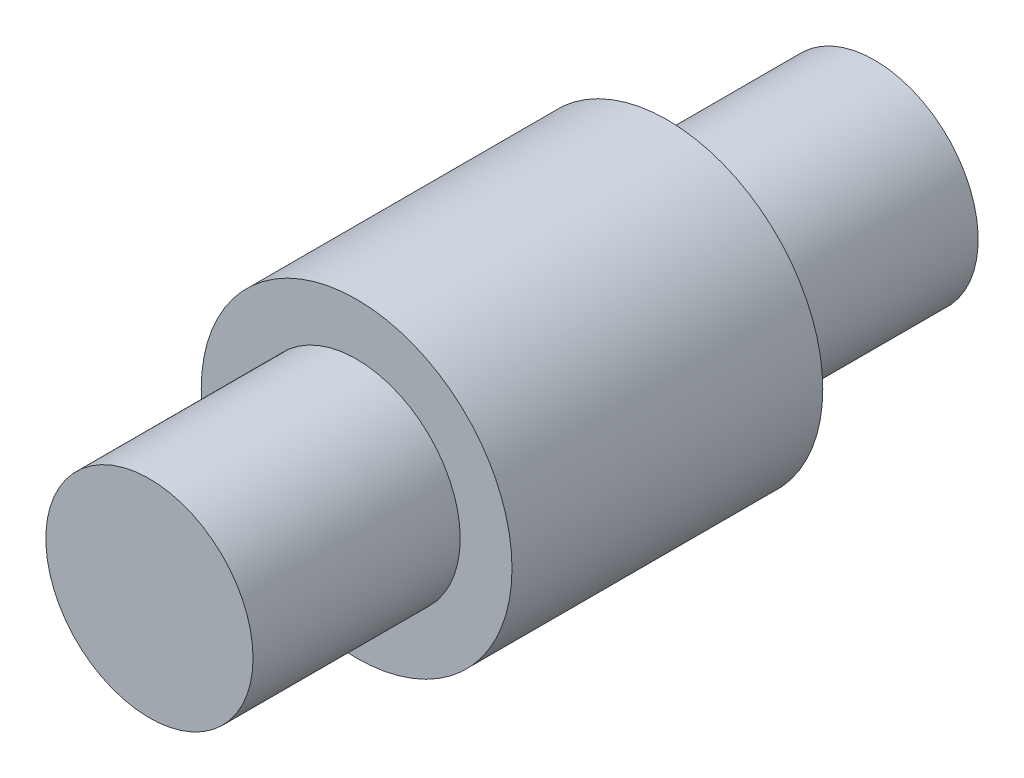
ISO-10303-21;
HEADER;
FILE_DESCRIPTION(('STEP AP214'),'2;1');
FILE_NAME('part.step','',(''),(''),'','','');
FILE_SCHEMA(('AUTOMOTIVE_DESIGN { 1 0 10303 214 1 1 1 1 }'));
ENDSEC;
DATA;
#1=APPLICATION_CONTEXT('core data for automotive mechanical design processes');
#2=APPLICATION_PROTOCOL_DEFINITION('international standard','automotive_design',2000,#1);
#3=PRODUCT_CONTEXT('',#1,'mechanical');
#4=PRODUCT('Part','Part','',(#3));
#5=PRODUCT_RELATED_PRODUCT_CATEGORY('part','',(#4));
#6=PRODUCT_DEFINITION_FORMATION('','',#4);
#7=PRODUCT_DEFINITION_CONTEXT('part definition',#1,'design');
#8=PRODUCT_DEFINITION('design','',#6,#7);
#9=PRODUCT_DEFINITION_SHAPE('','',#8);
#10=(LENGTH_UNIT() NAMED_UNIT(*) SI_UNIT(.MILLI.,.METRE.));
#11=(NAMED_UNIT(*) PLANE_ANGLE_UNIT() SI_UNIT($,.RADIAN.));
#12=(NAMED_UNIT(*) SI_UNIT($,.STERADIAN.) SOLID_ANGLE_UNIT());
#13=UNCERTAINTY_MEASURE_WITH_UNIT(LENGTH_MEASURE(1.E-05),#10,'distance_accuracy_value','');
#14=(GEOMETRIC_REPRESENTATION_CONTEXT(3) GLOBAL_UNCERTAINTY_ASSIGNED_CONTEXT((#13)) GLOBAL_UNIT_ASSIGNED_CONTEXT((#10,
#11,#12)) REPRESENTATION_CONTEXT('',''));
#15=CARTESIAN_POINT('',(0.,0.,0.));
#16=DIRECTION('',(0.,0.,1.));
#17=DIRECTION('',(1.,0.,0.));
#18=AXIS2_PLACEMENT_3D('',#15,#16,#17);
#19=CARTESIAN_POINT('',(0.,0.,15.));
#20=DIRECTION('',(0.,0.,-1.));
#21=DIRECTION('',(-1.,0.,0.));
#22=AXIS2_PLACEMENT_3D('',#19,#20,#21);
#23=CYLINDRICAL_SURFACE('',#22,15.);
#24=CARTESIAN_POINT('',(0.,0.,15.));
#25=DIRECTION('',(0.,0.,1.));
#26=DIRECTION('',(1.,0.,0.));
#27=AXIS2_PLACEMENT_3D('',#24,#25,#26);
#28=CIRCLE('',#27,15.);
#29=CARTESIAN_POINT('',(15.,0.,15.));
#30=VERTEX_POINT('',#29);
#31=EDGE_CURVE('E48',#30,#30,#28,.T.);
#32=ORIENTED_EDGE('',*,*,#31,.F.);
#33=EDGE_LOOP('',(#32));
#34=FACE_BOUND('',#33,.T.);
#35=CARTESIAN_POINT('',(0.,0.,-15.));
#36=DIRECTION('',(0.,0.,1.));
#37=DIRECTION('',(1.,0.,0.));
#38=AXIS2_PLACEMENT_3D('',#35,#36,#37);
#39=CIRCLE('',#38,15.);
#40=CARTESIAN_POINT('',(15.,0.,-15.));
#41=VERTEX_POINT('',#40);
#42=EDGE_CURVE('E39',#41,#41,#39,.T.);
#43=ORIENTED_EDGE('',*,*,#42,.T.);
#44=EDGE_LOOP('',(#43));
#45=FACE_BOUND('',#44,.T.);
#46=ADVANCED_FACE('F36',(#34,#45),#23,.T.);
#47=CARTESIAN_POINT('',(0.,0.,15.));
#48=DIRECTION('',(0.,0.,1.));
#49=DIRECTION('',(1.,0.,0.));
#50=AXIS2_PLACEMENT_3D('',#47,#48,#49);
#51=PLANE('',#50);
#52=CARTESIAN_POINT('',(0.,0.,15.));
#53=DIRECTION('',(0.,0.,1.));
#54=DIRECTION('',(1.,0.,0.));
#55=AXIS2_PLACEMENT_3D('',#52,#53,#54);
#56=CIRCLE('',#55,10.);
#57=CARTESIAN_POINT('',(10.,0.,15.));
#58=VERTEX_POINT('',#57);
#59=EDGE_CURVE('E43',#58,#58,#56,.T.);
#60=ORIENTED_EDGE('',*,*,#59,.F.);
#61=EDGE_LOOP('',(#60));
#62=FACE_BOUND('',#61,.T.);
#63=ORIENTED_EDGE('',*,*,#31,.T.);
#64=EDGE_LOOP('',(#63));
#65=FACE_BOUND('',#64,.T.);
#66=ADVANCED_FACE('F65',(#62,#65),#51,.T.);
#67=CARTESIAN_POINT('',(0.,0.,-15.));
#68=DIRECTION('',(0.,0.,1.));
#69=DIRECTION('',(1.,0.,0.));
#70=AXIS2_PLACEMENT_3D('',#67,#68,#69);
#71=PLANE('',#70);
#72=CARTESIAN_POINT('',(0.,0.,-15.));
#73=DIRECTION('',(0.,0.,-1.));
#74=DIRECTION('',(-1.,0.,0.));
#75=AXIS2_PLACEMENT_3D('',#72,#73,#74);
#76=CIRCLE('',#75,10.);
#77=CARTESIAN_POINT('',(-10.,0.,-15.));
#78=VERTEX_POINT('',#77);
#79=EDGE_CURVE('E10',#78,#78,#76,.T.);
#80=ORIENTED_EDGE('',*,*,#79,.F.);
#81=EDGE_LOOP('',(#80));
#82=FACE_BOUND('',#81,.T.);
#83=ORIENTED_EDGE('',*,*,#42,.F.);
#84=EDGE_LOOP('',(#83));
#85=FACE_BOUND('',#84,.T.);
#86=ADVANCED_FACE('F62',(#82,#85),#71,.F.);
#87=CARTESIAN_POINT('',(0.,0.,35.));
#88=DIRECTION('',(0.,0.,-1.));
#89=DIRECTION('',(-1.,0.,0.));
#90=AXIS2_PLACEMENT_3D('',#87,#88,#89);
#91=CYLINDRICAL_SURFACE('',#90,10.);
#92=CARTESIAN_POINT('',(0.,0.,35.));
#93=DIRECTION('',(0.,0.,1.));
#94=DIRECTION('',(1.,0.,0.));
#95=AXIS2_PLACEMENT_3D('',#92,#93,#94);
#96=CIRCLE('',#95,10.);
#97=CARTESIAN_POINT('',(10.,0.,35.));
#98=VERTEX_POINT('',#97);
#99=EDGE_CURVE('E53',#98,#98,#96,.T.);
#100=ORIENTED_EDGE('',*,*,#99,.F.);
#101=EDGE_LOOP('',(#100));
#102=FACE_BOUND('',#101,.T.);
#103=ORIENTED_EDGE('',*,*,#59,.T.);
#104=EDGE_LOOP('',(#103));
#105=FACE_BOUND('',#104,.T.);
#106=ADVANCED_FACE('F64',(#102,#105),#91,.T.);
#107=CARTESIAN_POINT('',(0.,0.,35.));
#108=DIRECTION('',(0.,0.,1.));
#109=DIRECTION('',(1.,0.,0.));
#110=AXIS2_PLACEMENT_3D('',#107,#108,#109);
#111=PLANE('',#110);
#112=ORIENTED_EDGE('',*,*,#99,.T.);
#113=EDGE_LOOP('',(#112));
#114=FACE_BOUND('',#113,.T.);
#115=ADVANCED_FACE('F71',(#114),#111,.T.);
#116=CARTESIAN_POINT('',(0.,0.,-35.));
#117=DIRECTION('',(0.,0.,1.));
#118=DIRECTION('',(1.,0.,0.));
#119=AXIS2_PLACEMENT_3D('',#116,#117,#118);
#120=CYLINDRICAL_SURFACE('',#119,10.);
#121=CARTESIAN_POINT('',(0.,0.,-35.));
#122=DIRECTION('',(0.,0.,-1.));
#123=DIRECTION('',(-1.,0.,0.));
#124=AXIS2_PLACEMENT_3D('',#121,#122,#123);
#125=CIRCLE('',#124,10.);
#126=CARTESIAN_POINT('',(-10.,0.,-35.));
#127=VERTEX_POINT('',#126);
#128=EDGE_CURVE('E52',#127,#127,#125,.T.);
#129=ORIENTED_EDGE('',*,*,#128,.F.);
#130=EDGE_LOOP('',(#129));
#131=FACE_BOUND('',#130,.T.);
#132=ORIENTED_EDGE('',*,*,#79,.T.);
#133=EDGE_LOOP('',(#132));
#134=FACE_BOUND('',#133,.T.);
#135=ADVANCED_FACE('F104',(#131,#134),#120,.T.);
#136=CARTESIAN_POINT('',(0.,0.,-35.));
#137=DIRECTION('',(0.,0.,-1.));
#138=DIRECTION('',(-1.,0.,0.));
#139=AXIS2_PLACEMENT_3D('',#136,#137,#138);
#140=PLANE('',#139);
#141=ORIENTED_EDGE('',*,*,#128,.T.);
#142=EDGE_LOOP('',(#141));
#143=FACE_BOUND('',#142,.T.);
#144=ADVANCED_FACE('F113',(#143),#140,.T.);
#145=CLOSED_SHELL('',(#46,#66,#86,#106,#115,#135,#144));
#146=MANIFOLD_SOLID_BREP('B2',#145);
#147=ADVANCED_BREP_SHAPE_REPRESENTATION('',(#18,#146),#14);
#148=SHAPE_DEFINITION_REPRESENTATION(#9,#147);
ENDSEC;
END-ISO-10303-21;
